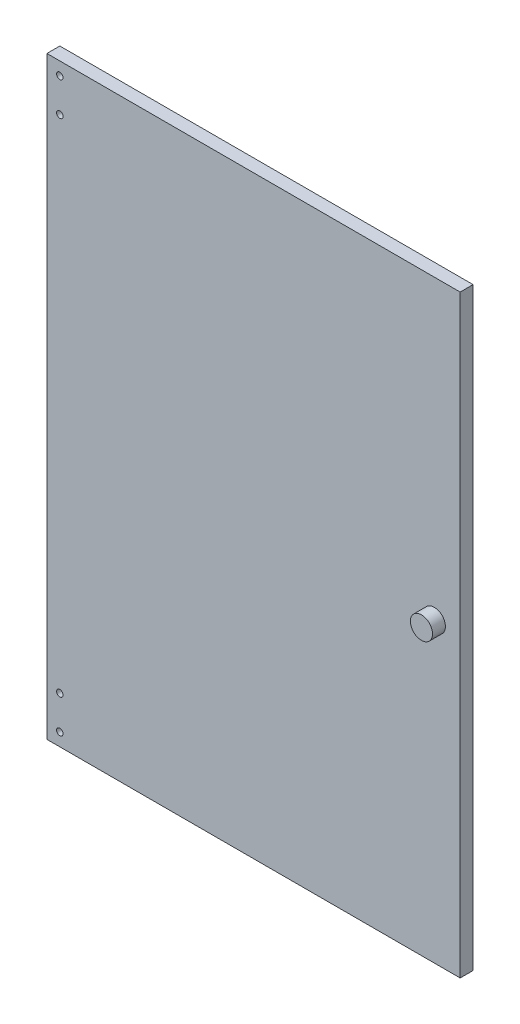
ISO-10303-21;
HEADER;
FILE_DESCRIPTION(('STEP AP214'),'2;1');
FILE_NAME('part.step','',(''),(''),'','','');
FILE_SCHEMA(('AUTOMOTIVE_DESIGN { 1 0 10303 214 1 1 1 1 }'));
ENDSEC;
DATA;
#1=APPLICATION_CONTEXT('core data for automotive mechanical design processes');
#2=APPLICATION_PROTOCOL_DEFINITION('international standard','automotive_design',2000,#1);
#3=PRODUCT_CONTEXT('',#1,'mechanical');
#4=PRODUCT('Part','Part','',(#3));
#5=PRODUCT_RELATED_PRODUCT_CATEGORY('part','',(#4));
#6=PRODUCT_DEFINITION_FORMATION('','',#4);
#7=PRODUCT_DEFINITION_CONTEXT('part definition',#1,'design');
#8=PRODUCT_DEFINITION('design','',#6,#7);
#9=PRODUCT_DEFINITION_SHAPE('','',#8);
#10=(LENGTH_UNIT() NAMED_UNIT(*) SI_UNIT(.MILLI.,.METRE.));
#11=(NAMED_UNIT(*) PLANE_ANGLE_UNIT() SI_UNIT($,.RADIAN.));
#12=(NAMED_UNIT(*) SI_UNIT($,.STERADIAN.) SOLID_ANGLE_UNIT());
#13=UNCERTAINTY_MEASURE_WITH_UNIT(LENGTH_MEASURE(1.E-05),#10,'distance_accuracy_value','');
#14=(GEOMETRIC_REPRESENTATION_CONTEXT(3) GLOBAL_UNCERTAINTY_ASSIGNED_CONTEXT((#13)) GLOBAL_UNIT_ASSIGNED_CONTEXT((#10,
#11,#12)) REPRESENTATION_CONTEXT('',''));
#15=CARTESIAN_POINT('',(0.,0.,0.));
#16=DIRECTION('',(0.,0.,1.));
#17=DIRECTION('',(1.,0.,0.));
#18=AXIS2_PLACEMENT_3D('',#15,#16,#17);
#19=CARTESIAN_POINT('',(0.,0.,10.));
#20=DIRECTION('',(0.,0.,1.));
#21=DIRECTION('',(1.,0.,0.));
#22=AXIS2_PLACEMENT_3D('',#19,#20,#21);
#23=PLANE('',#22);
#24=CARTESIAN_POINT('',(140.,0.,10.));
#25=DIRECTION('',(0.,0.,1.));
#26=DIRECTION('',(1.,0.,0.));
#27=AXIS2_PLACEMENT_3D('',#24,#25,#26);
#28=CIRCLE('',#27,8.57840359296438);
#29=CARTESIAN_POINT('',(148.578403592964,0.,10.));
#30=VERTEX_POINT('',#29);
#31=EDGE_CURVE('E141',#30,#30,#28,.T.);
#32=ORIENTED_EDGE('',*,*,#31,.F.);
#33=EDGE_LOOP('',(#32));
#34=FACE_BOUND('',#33,.T.);
#35=CARTESIAN_POINT('',(-150.,-194.,10.));
#36=DIRECTION('',(0.,0.,1.));
#37=DIRECTION('',(1.,0.,0.));
#38=AXIS2_PLACEMENT_3D('',#35,#36,#37);
#39=CIRCLE('',#38,2.5);
#40=CARTESIAN_POINT('',(-147.5,-194.,10.));
#41=VERTEX_POINT('',#40);
#42=EDGE_CURVE('E125',#41,#41,#39,.T.);
#43=ORIENTED_EDGE('',*,*,#42,.F.);
#44=EDGE_LOOP('',(#43));
#45=FACE_BOUND('',#44,.T.);
#46=CARTESIAN_POINT('',(-150.,220.,10.));
#47=DIRECTION('',(0.,0.,1.));
#48=DIRECTION('',(1.,0.,0.));
#49=AXIS2_PLACEMENT_3D('',#46,#47,#48);
#50=CIRCLE('',#49,2.5);
#51=CARTESIAN_POINT('',(-147.5,220.,10.));
#52=VERTEX_POINT('',#51);
#53=EDGE_CURVE('E114',#52,#52,#50,.T.);
#54=ORIENTED_EDGE('',*,*,#53,.F.);
#55=EDGE_LOOP('',(#54));
#56=FACE_BOUND('',#55,.T.);
#57=DIRECTION('',(0.,1.,0.));
#58=VECTOR('',#57,1.);
#59=CARTESIAN_POINT('',(160.,230.,10.));
#60=LINE('',#59,#58);
#61=CARTESIAN_POINT('',(160.,-230.,10.));
#62=VERTEX_POINT('',#61);
#63=CARTESIAN_POINT('',(160.,230.,10.));
#64=VERTEX_POINT('',#63);
#65=EDGE_CURVE('E84',#62,#64,#60,.T.);
#66=ORIENTED_EDGE('',*,*,#65,.T.);
#67=DIRECTION('',(-1.,0.,0.));
#68=VECTOR('',#67,1.);
#69=CARTESIAN_POINT('',(-160.,230.,10.));
#70=LINE('',#69,#68);
#71=CARTESIAN_POINT('',(-160.,230.,10.));
#72=VERTEX_POINT('',#71);
#73=EDGE_CURVE('E79',#64,#72,#70,.T.);
#74=ORIENTED_EDGE('',*,*,#73,.T.);
#75=DIRECTION('',(0.,-1.,0.));
#76=VECTOR('',#75,1.);
#77=CARTESIAN_POINT('',(-160.,230.,10.));
#78=LINE('',#77,#76);
#79=CARTESIAN_POINT('',(-160.,-230.,10.));
#80=VERTEX_POINT('',#79);
#81=EDGE_CURVE('E82',#72,#80,#78,.T.);
#82=ORIENTED_EDGE('',*,*,#81,.T.);
#83=DIRECTION('',(1.,0.,0.));
#84=VECTOR('',#83,1.);
#85=CARTESIAN_POINT('',(-160.,-230.,10.));
#86=LINE('',#85,#84);
#87=EDGE_CURVE('E49',#80,#62,#86,.T.);
#88=ORIENTED_EDGE('',*,*,#87,.T.);
#89=EDGE_LOOP('',(#66,#74,#82,#88));
#90=FACE_BOUND('',#89,.T.);
#91=CARTESIAN_POINT('',(-150.,-220.,10.));
#92=DIRECTION('',(0.,0.,1.));
#93=DIRECTION('',(1.,0.,0.));
#94=AXIS2_PLACEMENT_3D('',#91,#92,#93);
#95=CIRCLE('',#94,2.5);
#96=CARTESIAN_POINT('',(-147.5,-220.,10.));
#97=VERTEX_POINT('',#96);
#98=EDGE_CURVE('E99',#97,#97,#95,.T.);
#99=ORIENTED_EDGE('',*,*,#98,.F.);
#100=EDGE_LOOP('',(#99));
#101=FACE_BOUND('',#100,.T.);
#102=CARTESIAN_POINT('',(-150.,194.,10.));
#103=DIRECTION('',(0.,0.,1.));
#104=DIRECTION('',(1.,0.,0.));
#105=AXIS2_PLACEMENT_3D('',#102,#103,#104);
#106=CIRCLE('',#105,2.5);
#107=CARTESIAN_POINT('',(-147.5,194.,10.));
#108=VERTEX_POINT('',#107);
#109=EDGE_CURVE('E129',#108,#108,#106,.T.);
#110=ORIENTED_EDGE('',*,*,#109,.F.);
#111=EDGE_LOOP('',(#110));
#112=FACE_BOUND('',#111,.T.);
#113=ADVANCED_FACE('F32',(#34,#45,#56,#90,#101,#112),#23,.T.);
#114=CARTESIAN_POINT('',(0.,0.,0.));
#115=DIRECTION('',(0.,0.,1.));
#116=DIRECTION('',(1.,0.,0.));
#117=AXIS2_PLACEMENT_3D('',#114,#115,#116);
#118=PLANE('',#117);
#119=DIRECTION('',(0.,1.,0.));
#120=VECTOR('',#119,1.);
#121=CARTESIAN_POINT('',(160.,230.,0.));
#122=LINE('',#121,#120);
#123=CARTESIAN_POINT('',(160.,-230.,0.));
#124=VERTEX_POINT('',#123);
#125=CARTESIAN_POINT('',(160.,230.,0.));
#126=VERTEX_POINT('',#125);
#127=EDGE_CURVE('E96',#124,#126,#122,.T.);
#128=ORIENTED_EDGE('',*,*,#127,.F.);
#129=DIRECTION('',(1.,0.,0.));
#130=VECTOR('',#129,1.);
#131=CARTESIAN_POINT('',(-160.,-230.,0.));
#132=LINE('',#131,#130);
#133=CARTESIAN_POINT('',(-160.,-230.,0.));
#134=VERTEX_POINT('',#133);
#135=EDGE_CURVE('E72',#134,#124,#132,.T.);
#136=ORIENTED_EDGE('',*,*,#135,.F.);
#137=DIRECTION('',(0.,-1.,0.));
#138=VECTOR('',#137,1.);
#139=CARTESIAN_POINT('',(-160.,230.,0.));
#140=LINE('',#139,#138);
#141=CARTESIAN_POINT('',(-160.,230.,0.));
#142=VERTEX_POINT('',#141);
#143=EDGE_CURVE('E66',#142,#134,#140,.T.);
#144=ORIENTED_EDGE('',*,*,#143,.F.);
#145=DIRECTION('',(-1.,0.,0.));
#146=VECTOR('',#145,1.);
#147=CARTESIAN_POINT('',(-160.,230.,0.));
#148=LINE('',#147,#146);
#149=EDGE_CURVE('E88',#126,#142,#148,.T.);
#150=ORIENTED_EDGE('',*,*,#149,.F.);
#151=EDGE_LOOP('',(#128,#136,#144,#150));
#152=FACE_BOUND('',#151,.T.);
#153=CARTESIAN_POINT('',(-150.,-220.,0.));
#154=DIRECTION('',(0.,0.,1.));
#155=DIRECTION('',(1.,0.,0.));
#156=AXIS2_PLACEMENT_3D('',#153,#154,#155);
#157=CIRCLE('',#156,2.5);
#158=CARTESIAN_POINT('',(-147.5,-220.,0.));
#159=VERTEX_POINT('',#158);
#160=EDGE_CURVE('E111',#159,#159,#157,.T.);
#161=ORIENTED_EDGE('',*,*,#160,.T.);
#162=EDGE_LOOP('',(#161));
#163=FACE_BOUND('',#162,.T.);
#164=CARTESIAN_POINT('',(-150.,220.,0.));
#165=DIRECTION('',(0.,0.,1.));
#166=DIRECTION('',(1.,0.,0.));
#167=AXIS2_PLACEMENT_3D('',#164,#165,#166);
#168=CIRCLE('',#167,2.5);
#169=CARTESIAN_POINT('',(-147.5,220.,0.));
#170=VERTEX_POINT('',#169);
#171=EDGE_CURVE('E117',#170,#170,#168,.T.);
#172=ORIENTED_EDGE('',*,*,#171,.T.);
#173=EDGE_LOOP('',(#172));
#174=FACE_BOUND('',#173,.T.);
#175=CARTESIAN_POINT('',(140.,0.,0.));
#176=DIRECTION('',(0.,0.,1.));
#177=DIRECTION('',(-1.,0.,0.));
#178=AXIS2_PLACEMENT_3D('',#175,#176,#177);
#179=CIRCLE('',#178,2.99999999999999);
#180=CARTESIAN_POINT('',(137.,0.,0.));
#181=VERTEX_POINT('',#180);
#182=EDGE_CURVE('E120',#181,#181,#179,.T.);
#183=ORIENTED_EDGE('',*,*,#182,.T.);
#184=EDGE_LOOP('',(#183));
#185=FACE_BOUND('',#184,.T.);
#186=CARTESIAN_POINT('',(-150.,-194.,0.));
#187=DIRECTION('',(0.,0.,1.));
#188=DIRECTION('',(1.,0.,0.));
#189=AXIS2_PLACEMENT_3D('',#186,#187,#188);
#190=CIRCLE('',#189,2.5);
#191=CARTESIAN_POINT('',(-147.5,-194.,0.));
#192=VERTEX_POINT('',#191);
#193=EDGE_CURVE('E126',#192,#192,#190,.T.);
#194=ORIENTED_EDGE('',*,*,#193,.T.);
#195=EDGE_LOOP('',(#194));
#196=FACE_BOUND('',#195,.T.);
#197=CARTESIAN_POINT('',(-150.,194.,0.));
#198=DIRECTION('',(0.,0.,1.));
#199=DIRECTION('',(1.,0.,0.));
#200=AXIS2_PLACEMENT_3D('',#197,#198,#199);
#201=CIRCLE('',#200,2.5);
#202=CARTESIAN_POINT('',(-147.5,194.,0.));
#203=VERTEX_POINT('',#202);
#204=EDGE_CURVE('E132',#203,#203,#201,.T.);
#205=ORIENTED_EDGE('',*,*,#204,.T.);
#206=EDGE_LOOP('',(#205));
#207=FACE_BOUND('',#206,.T.);
#208=ADVANCED_FACE('F107',(#152,#163,#174,#185,#196,#207),#118,.F.);
#209=CARTESIAN_POINT('',(160.,230.,10.));
#210=DIRECTION('',(-1.,0.,0.));
#211=DIRECTION('',(0.,-1.,0.));
#212=AXIS2_PLACEMENT_3D('',#209,#210,#211);
#213=PLANE('',#212);
#214=ORIENTED_EDGE('',*,*,#127,.T.);
#215=DIRECTION('',(0.,0.,-1.));
#216=VECTOR('',#215,1.);
#217=CARTESIAN_POINT('',(160.,230.,10.));
#218=LINE('',#217,#216);
#219=EDGE_CURVE('E11',#64,#126,#218,.T.);
#220=ORIENTED_EDGE('',*,*,#219,.F.);
#221=ORIENTED_EDGE('',*,*,#65,.F.);
#222=DIRECTION('',(0.,0.,-1.));
#223=VECTOR('',#222,1.);
#224=CARTESIAN_POINT('',(160.,-230.,10.));
#225=LINE('',#224,#223);
#226=EDGE_CURVE('E92',#62,#124,#225,.T.);
#227=ORIENTED_EDGE('',*,*,#226,.T.);
#228=EDGE_LOOP('',(#214,#220,#221,#227));
#229=FACE_BOUND('',#228,.T.);
#230=ADVANCED_FACE('F34',(#229),#213,.F.);
#231=CARTESIAN_POINT('',(-160.,230.,10.));
#232=DIRECTION('',(0.,-1.,0.));
#233=DIRECTION('',(1.,0.,0.));
#234=AXIS2_PLACEMENT_3D('',#231,#232,#233);
#235=PLANE('',#234);
#236=ORIENTED_EDGE('',*,*,#149,.T.);
#237=DIRECTION('',(0.,0.,-1.));
#238=VECTOR('',#237,1.);
#239=CARTESIAN_POINT('',(-160.,230.,10.));
#240=LINE('',#239,#238);
#241=EDGE_CURVE('E41',#72,#142,#240,.T.);
#242=ORIENTED_EDGE('',*,*,#241,.F.);
#243=ORIENTED_EDGE('',*,*,#73,.F.);
#244=ORIENTED_EDGE('',*,*,#219,.T.);
#245=EDGE_LOOP('',(#236,#242,#243,#244));
#246=FACE_BOUND('',#245,.T.);
#247=ADVANCED_FACE('F87',(#246),#235,.F.);
#248=CARTESIAN_POINT('',(-160.,230.,10.));
#249=DIRECTION('',(1.,0.,0.));
#250=DIRECTION('',(0.,1.,0.));
#251=AXIS2_PLACEMENT_3D('',#248,#249,#250);
#252=PLANE('',#251);
#253=ORIENTED_EDGE('',*,*,#143,.T.);
#254=DIRECTION('',(0.,0.,-1.));
#255=VECTOR('',#254,1.);
#256=CARTESIAN_POINT('',(-160.,-230.,10.));
#257=LINE('',#256,#255);
#258=EDGE_CURVE('E89',#80,#134,#257,.T.);
#259=ORIENTED_EDGE('',*,*,#258,.F.);
#260=ORIENTED_EDGE('',*,*,#81,.F.);
#261=ORIENTED_EDGE('',*,*,#241,.T.);
#262=EDGE_LOOP('',(#253,#259,#260,#261));
#263=FACE_BOUND('',#262,.T.);
#264=ADVANCED_FACE('F90',(#263),#252,.F.);
#265=CARTESIAN_POINT('',(-160.,-230.,10.));
#266=DIRECTION('',(0.,1.,0.));
#267=DIRECTION('',(-1.,0.,0.));
#268=AXIS2_PLACEMENT_3D('',#265,#266,#267);
#269=PLANE('',#268);
#270=ORIENTED_EDGE('',*,*,#135,.T.);
#271=ORIENTED_EDGE('',*,*,#226,.F.);
#272=ORIENTED_EDGE('',*,*,#87,.F.);
#273=ORIENTED_EDGE('',*,*,#258,.T.);
#274=EDGE_LOOP('',(#270,#271,#272,#273));
#275=FACE_BOUND('',#274,.T.);
#276=ADVANCED_FACE('F104',(#275),#269,.F.);
#277=CARTESIAN_POINT('',(-150.,-220.,10.));
#278=DIRECTION('',(0.,0.,-1.));
#279=DIRECTION('',(-1.,0.,0.));
#280=AXIS2_PLACEMENT_3D('',#277,#278,#279);
#281=CYLINDRICAL_SURFACE('',#280,2.5);
#282=ORIENTED_EDGE('',*,*,#98,.T.);
#283=EDGE_LOOP('',(#282));
#284=FACE_BOUND('',#283,.T.);
#285=ORIENTED_EDGE('',*,*,#160,.F.);
#286=EDGE_LOOP('',(#285));
#287=FACE_BOUND('',#286,.T.);
#288=ADVANCED_FACE('F167',(#284,#287),#281,.F.);
#289=CARTESIAN_POINT('',(-150.,220.,10.));
#290=DIRECTION('',(0.,0.,-1.));
#291=DIRECTION('',(-1.,0.,0.));
#292=AXIS2_PLACEMENT_3D('',#289,#290,#291);
#293=CYLINDRICAL_SURFACE('',#292,2.5);
#294=ORIENTED_EDGE('',*,*,#53,.T.);
#295=EDGE_LOOP('',(#294));
#296=FACE_BOUND('',#295,.T.);
#297=ORIENTED_EDGE('',*,*,#171,.F.);
#298=EDGE_LOOP('',(#297));
#299=FACE_BOUND('',#298,.T.);
#300=ADVANCED_FACE('F163',(#296,#299),#293,.F.);
#301=CARTESIAN_POINT('',(140.,0.,10.));
#302=DIRECTION('',(0.,0.,-1.));
#303=DIRECTION('',(-1.,0.,0.));
#304=AXIS2_PLACEMENT_3D('',#301,#302,#303);
#305=CYLINDRICAL_SURFACE('',#304,2.99999999999999);
#306=CARTESIAN_POINT('',(140.,0.,10.));
#307=DIRECTION('',(0.,0.,1.));
#308=DIRECTION('',(1.,0.,0.));
#309=AXIS2_PLACEMENT_3D('',#306,#307,#308);
#310=CIRCLE('',#309,2.99999999999999);
#311=CARTESIAN_POINT('',(143.,0.,10.));
#312=VERTEX_POINT('',#311);
#313=EDGE_CURVE('E135',#312,#312,#310,.T.);
#314=ORIENTED_EDGE('',*,*,#313,.T.);
#315=EDGE_LOOP('',(#314));
#316=FACE_BOUND('',#315,.T.);
#317=ORIENTED_EDGE('',*,*,#182,.F.);
#318=EDGE_LOOP('',(#317));
#319=FACE_BOUND('',#318,.T.);
#320=ADVANCED_FACE('F166',(#316,#319),#305,.F.);
#321=CARTESIAN_POINT('',(-150.,-194.,10.));
#322=DIRECTION('',(0.,0.,-1.));
#323=DIRECTION('',(-1.,0.,0.));
#324=AXIS2_PLACEMENT_3D('',#321,#322,#323);
#325=CYLINDRICAL_SURFACE('',#324,2.5);
#326=ORIENTED_EDGE('',*,*,#42,.T.);
#327=EDGE_LOOP('',(#326));
#328=FACE_BOUND('',#327,.T.);
#329=ORIENTED_EDGE('',*,*,#193,.F.);
#330=EDGE_LOOP('',(#329));
#331=FACE_BOUND('',#330,.T.);
#332=ADVANCED_FACE('F182',(#328,#331),#325,.F.);
#333=CARTESIAN_POINT('',(-150.,194.,10.));
#334=DIRECTION('',(0.,0.,-1.));
#335=DIRECTION('',(-1.,0.,0.));
#336=AXIS2_PLACEMENT_3D('',#333,#334,#335);
#337=CYLINDRICAL_SURFACE('',#336,2.5);
#338=ORIENTED_EDGE('',*,*,#109,.T.);
#339=EDGE_LOOP('',(#338));
#340=FACE_BOUND('',#339,.T.);
#341=ORIENTED_EDGE('',*,*,#204,.F.);
#342=EDGE_LOOP('',(#341));
#343=FACE_BOUND('',#342,.T.);
#344=ADVANCED_FACE('F180',(#340,#343),#337,.F.);
#345=CARTESIAN_POINT('',(140.,0.,10.));
#346=DIRECTION('',(0.,0.,1.));
#347=DIRECTION('',(1.,0.,0.));
#348=AXIS2_PLACEMENT_3D('',#345,#346,#347);
#349=PLANE('',#348);
#350=ORIENTED_EDGE('',*,*,#313,.F.);
#351=EDGE_LOOP('',(#350));
#352=FACE_BOUND('',#351,.T.);
#353=ADVANCED_FACE('F152',(#352),#349,.F.);
#354=CARTESIAN_POINT('',(140.,0.,20.));
#355=DIRECTION('',(0.,0.,-1.));
#356=DIRECTION('',(-1.,0.,0.));
#357=AXIS2_PLACEMENT_3D('',#354,#355,#356);
#358=CYLINDRICAL_SURFACE('',#357,8.57840359296438);
#359=CARTESIAN_POINT('',(140.,0.,20.));
#360=DIRECTION('',(0.,0.,1.));
#361=DIRECTION('',(1.,0.,0.));
#362=AXIS2_PLACEMENT_3D('',#359,#360,#361);
#363=CIRCLE('',#362,8.57840359296438);
#364=CARTESIAN_POINT('',(148.578403592964,0.,20.));
#365=VERTEX_POINT('',#364);
#366=EDGE_CURVE('E140',#365,#365,#363,.T.);
#367=ORIENTED_EDGE('',*,*,#366,.F.);
#368=EDGE_LOOP('',(#367));
#369=FACE_BOUND('',#368,.T.);
#370=ORIENTED_EDGE('',*,*,#31,.T.);
#371=EDGE_LOOP('',(#370));
#372=FACE_BOUND('',#371,.T.);
#373=ADVANCED_FACE('F149',(#369,#372),#358,.T.);
#374=CARTESIAN_POINT('',(140.,0.,20.));
#375=DIRECTION('',(0.,0.,1.));
#376=DIRECTION('',(1.,0.,0.));
#377=AXIS2_PLACEMENT_3D('',#374,#375,#376);
#378=PLANE('',#377);
#379=ORIENTED_EDGE('',*,*,#366,.T.);
#380=EDGE_LOOP('',(#379));
#381=FACE_BOUND('',#380,.T.);
#382=ADVANCED_FACE('F147',(#381),#378,.T.);
#383=CLOSED_SHELL('',(#113,#208,#230,#247,#264,#276,#288,#300,#320,#332,#344,#353,#373,#382));
#384=MANIFOLD_SOLID_BREP('B2',#383);
#385=ADVANCED_BREP_SHAPE_REPRESENTATION('',(#18,#384),#14);
#386=SHAPE_DEFINITION_REPRESENTATION(#9,#385);
ENDSEC;
END-ISO-10303-21;
